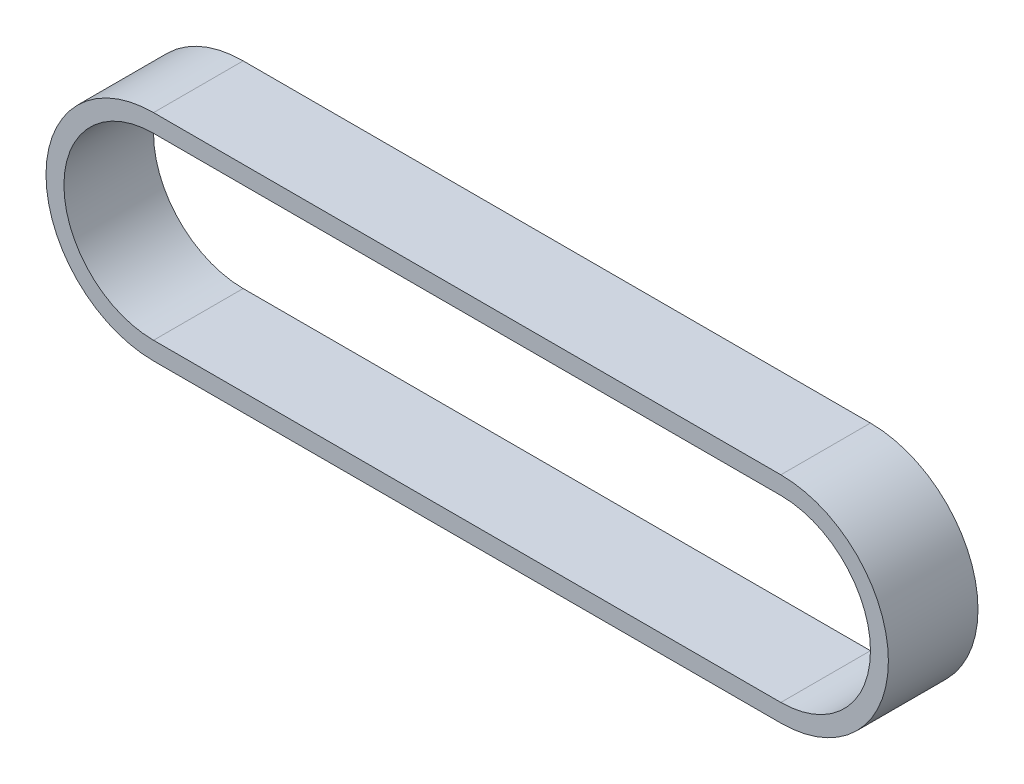
ISO-10303-21;
HEADER;
FILE_DESCRIPTION(('STEP AP214'),'2;1');
FILE_NAME('part.step','',(''),(''),'','','');
FILE_SCHEMA(('AUTOMOTIVE_DESIGN { 1 0 10303 214 1 1 1 1 }'));
ENDSEC;
DATA;
#1=APPLICATION_CONTEXT('core data for automotive mechanical design processes');
#2=APPLICATION_PROTOCOL_DEFINITION('international standard','automotive_design',2000,#1);
#3=PRODUCT_CONTEXT('',#1,'mechanical');
#4=PRODUCT('Part','Part','',(#3));
#5=PRODUCT_RELATED_PRODUCT_CATEGORY('part','',(#4));
#6=PRODUCT_DEFINITION_FORMATION('','',#4);
#7=PRODUCT_DEFINITION_CONTEXT('part definition',#1,'design');
#8=PRODUCT_DEFINITION('design','',#6,#7);
#9=PRODUCT_DEFINITION_SHAPE('','',#8);
#10=(LENGTH_UNIT() NAMED_UNIT(*) SI_UNIT(.MILLI.,.METRE.));
#11=(NAMED_UNIT(*) PLANE_ANGLE_UNIT() SI_UNIT($,.RADIAN.));
#12=(NAMED_UNIT(*) SI_UNIT($,.STERADIAN.) SOLID_ANGLE_UNIT());
#13=UNCERTAINTY_MEASURE_WITH_UNIT(LENGTH_MEASURE(1.E-05),#10,'distance_accuracy_value','');
#14=(GEOMETRIC_REPRESENTATION_CONTEXT(3) GLOBAL_UNCERTAINTY_ASSIGNED_CONTEXT((#13)) GLOBAL_UNIT_ASSIGNED_CONTEXT((#10,
#11,#12)) REPRESENTATION_CONTEXT('',''));
#15=CARTESIAN_POINT('',(0.,0.,0.));
#16=DIRECTION('',(0.,0.,1.));
#17=DIRECTION('',(1.,0.,0.));
#18=AXIS2_PLACEMENT_3D('',#15,#16,#17);
#19=CARTESIAN_POINT('',(0.,0.,5.));
#20=DIRECTION('',(0.,0.,1.));
#21=DIRECTION('',(1.,0.,0.));
#22=AXIS2_PLACEMENT_3D('',#19,#20,#21);
#23=PLANE('',#22);
#24=CARTESIAN_POINT('',(0.,0.,5.));
#25=DIRECTION('',(0.,0.,1.));
#26=DIRECTION('',(1.,0.,0.));
#27=AXIS2_PLACEMENT_3D('',#24,#25,#26);
#28=CIRCLE('',#27,6.);
#29=CARTESIAN_POINT('',(0.,6.,5.));
#30=VERTEX_POINT('',#29);
#31=CARTESIAN_POINT('',(0.,-6.,5.));
#32=VERTEX_POINT('',#31);
#33=EDGE_CURVE('E131',#30,#32,#28,.T.);
#34=ORIENTED_EDGE('',*,*,#33,.T.);
#35=DIRECTION('',(1.,0.,0.));
#36=VECTOR('',#35,1.);
#37=CARTESIAN_POINT('',(0.,-6.,5.));
#38=LINE('',#37,#36);
#39=CARTESIAN_POINT('',(35.,-6.,5.));
#40=VERTEX_POINT('',#39);
#41=EDGE_CURVE('E134',#32,#40,#38,.T.);
#42=ORIENTED_EDGE('',*,*,#41,.T.);
#43=CARTESIAN_POINT('',(35.,0.,5.));
#44=DIRECTION('',(0.,0.,1.));
#45=DIRECTION('',(1.,0.,0.));
#46=AXIS2_PLACEMENT_3D('',#43,#44,#45);
#47=CIRCLE('',#46,6.);
#48=CARTESIAN_POINT('',(35.,6.,5.));
#49=VERTEX_POINT('',#48);
#50=EDGE_CURVE('E137',#40,#49,#47,.T.);
#51=ORIENTED_EDGE('',*,*,#50,.T.);
#52=DIRECTION('',(-1.,0.,0.));
#53=VECTOR('',#52,1.);
#54=CARTESIAN_POINT('',(0.,6.,5.));
#55=LINE('',#54,#53);
#56=EDGE_CURVE('E139',#49,#30,#55,.T.);
#57=ORIENTED_EDGE('',*,*,#56,.T.);
#58=EDGE_LOOP('',(#34,#42,#51,#57));
#59=FACE_BOUND('',#58,.T.);
#60=DIRECTION('',(1.,0.,0.));
#61=VECTOR('',#60,1.);
#62=CARTESIAN_POINT('',(0.,-5.,5.));
#63=LINE('',#62,#61);
#64=CARTESIAN_POINT('',(0.,-5.,5.));
#65=VERTEX_POINT('',#64);
#66=CARTESIAN_POINT('',(35.,-5.,5.));
#67=VERTEX_POINT('',#66);
#68=EDGE_CURVE('E103',#65,#67,#63,.T.);
#69=ORIENTED_EDGE('',*,*,#68,.F.);
#70=CARTESIAN_POINT('',(0.,0.,5.));
#71=DIRECTION('',(0.,0.,1.));
#72=DIRECTION('',(1.,0.,0.));
#73=AXIS2_PLACEMENT_3D('',#70,#71,#72);
#74=CIRCLE('',#73,5.);
#75=CARTESIAN_POINT('',(0.,5.,5.));
#76=VERTEX_POINT('',#75);
#77=EDGE_CURVE('E95',#76,#65,#74,.T.);
#78=ORIENTED_EDGE('',*,*,#77,.F.);
#79=DIRECTION('',(-1.,0.,0.));
#80=VECTOR('',#79,1.);
#81=CARTESIAN_POINT('',(0.,5.,5.));
#82=LINE('',#81,#80);
#83=CARTESIAN_POINT('',(35.,5.,5.));
#84=VERTEX_POINT('',#83);
#85=EDGE_CURVE('E117',#84,#76,#82,.T.);
#86=ORIENTED_EDGE('',*,*,#85,.F.);
#87=CARTESIAN_POINT('',(35.,0.,5.));
#88=DIRECTION('',(0.,0.,1.));
#89=DIRECTION('',(1.,0.,0.));
#90=AXIS2_PLACEMENT_3D('',#87,#88,#89);
#91=CIRCLE('',#90,5.);
#92=EDGE_CURVE('E115',#67,#84,#91,.T.);
#93=ORIENTED_EDGE('',*,*,#92,.F.);
#94=EDGE_LOOP('',(#69,#78,#86,#93));
#95=FACE_BOUND('',#94,.T.);
#96=ADVANCED_FACE('F30',(#59,#95),#23,.T.);
#97=CARTESIAN_POINT('',(0.,0.,0.));
#98=DIRECTION('',(0.,0.,1.));
#99=DIRECTION('',(1.,0.,0.));
#100=AXIS2_PLACEMENT_3D('',#97,#98,#99);
#101=PLANE('',#100);
#102=CARTESIAN_POINT('',(0.,0.,0.));
#103=DIRECTION('',(0.,0.,1.));
#104=DIRECTION('',(1.,0.,0.));
#105=AXIS2_PLACEMENT_3D('',#102,#103,#104);
#106=CIRCLE('',#105,6.);
#107=CARTESIAN_POINT('',(0.,6.,0.));
#108=VERTEX_POINT('',#107);
#109=CARTESIAN_POINT('',(0.,-6.,0.));
#110=VERTEX_POINT('',#109);
#111=EDGE_CURVE('E111',#108,#110,#106,.T.);
#112=ORIENTED_EDGE('',*,*,#111,.F.);
#113=DIRECTION('',(-1.,0.,0.));
#114=VECTOR('',#113,1.);
#115=CARTESIAN_POINT('',(0.,6.,0.));
#116=LINE('',#115,#114);
#117=CARTESIAN_POINT('',(35.,6.,0.));
#118=VERTEX_POINT('',#117);
#119=EDGE_CURVE('E135',#118,#108,#116,.T.);
#120=ORIENTED_EDGE('',*,*,#119,.F.);
#121=CARTESIAN_POINT('',(35.,0.,0.));
#122=DIRECTION('',(0.,0.,1.));
#123=DIRECTION('',(1.,0.,0.));
#124=AXIS2_PLACEMENT_3D('',#121,#122,#123);
#125=CIRCLE('',#124,6.);
#126=CARTESIAN_POINT('',(35.,-6.,0.));
#127=VERTEX_POINT('',#126);
#128=EDGE_CURVE('E146',#127,#118,#125,.T.);
#129=ORIENTED_EDGE('',*,*,#128,.F.);
#130=DIRECTION('',(1.,0.,0.));
#131=VECTOR('',#130,1.);
#132=CARTESIAN_POINT('',(0.,-6.,0.));
#133=LINE('',#132,#131);
#134=EDGE_CURVE('E144',#110,#127,#133,.T.);
#135=ORIENTED_EDGE('',*,*,#134,.F.);
#136=EDGE_LOOP('',(#112,#120,#129,#135));
#137=FACE_BOUND('',#136,.T.);
#138=CARTESIAN_POINT('',(0.,0.,0.));
#139=DIRECTION('',(0.,0.,1.));
#140=DIRECTION('',(1.,0.,0.));
#141=AXIS2_PLACEMENT_3D('',#138,#139,#140);
#142=CIRCLE('',#141,5.);
#143=CARTESIAN_POINT('',(0.,5.,0.));
#144=VERTEX_POINT('',#143);
#145=CARTESIAN_POINT('',(0.,-5.,0.));
#146=VERTEX_POINT('',#145);
#147=EDGE_CURVE('E53',#144,#146,#142,.T.);
#148=ORIENTED_EDGE('',*,*,#147,.T.);
#149=DIRECTION('',(1.,0.,0.));
#150=VECTOR('',#149,1.);
#151=CARTESIAN_POINT('',(0.,-5.,0.));
#152=LINE('',#151,#150);
#153=CARTESIAN_POINT('',(35.,-5.,0.));
#154=VERTEX_POINT('',#153);
#155=EDGE_CURVE('E110',#146,#154,#152,.T.);
#156=ORIENTED_EDGE('',*,*,#155,.T.);
#157=CARTESIAN_POINT('',(35.,0.,0.));
#158=DIRECTION('',(0.,0.,1.));
#159=DIRECTION('',(1.,0.,0.));
#160=AXIS2_PLACEMENT_3D('',#157,#158,#159);
#161=CIRCLE('',#160,5.);
#162=CARTESIAN_POINT('',(35.,5.,0.));
#163=VERTEX_POINT('',#162);
#164=EDGE_CURVE('E123',#154,#163,#161,.T.);
#165=ORIENTED_EDGE('',*,*,#164,.T.);
#166=DIRECTION('',(-1.,0.,0.));
#167=VECTOR('',#166,1.);
#168=CARTESIAN_POINT('',(0.,5.,0.));
#169=LINE('',#168,#167);
#170=EDGE_CURVE('E104',#163,#144,#169,.T.);
#171=ORIENTED_EDGE('',*,*,#170,.T.);
#172=EDGE_LOOP('',(#148,#156,#165,#171));
#173=FACE_BOUND('',#172,.T.);
#174=ADVANCED_FACE('F164',(#137,#173),#101,.F.);
#175=CARTESIAN_POINT('',(0.,0.,5.));
#176=DIRECTION('',(0.,0.,-1.));
#177=DIRECTION('',(-1.,0.,0.));
#178=AXIS2_PLACEMENT_3D('',#175,#176,#177);
#179=CYLINDRICAL_SURFACE('',#178,6.);
#180=ORIENTED_EDGE('',*,*,#111,.T.);
#181=DIRECTION('',(0.,0.,-1.));
#182=VECTOR('',#181,1.);
#183=CARTESIAN_POINT('',(0.,-6.,5.));
#184=LINE('',#183,#182);
#185=EDGE_CURVE('E11',#32,#110,#184,.T.);
#186=ORIENTED_EDGE('',*,*,#185,.F.);
#187=ORIENTED_EDGE('',*,*,#33,.F.);
#188=DIRECTION('',(0.,0.,-1.));
#189=VECTOR('',#188,1.);
#190=CARTESIAN_POINT('',(0.,6.,5.));
#191=LINE('',#190,#189);
#192=EDGE_CURVE('E141',#30,#108,#191,.T.);
#193=ORIENTED_EDGE('',*,*,#192,.T.);
#194=EDGE_LOOP('',(#180,#186,#187,#193));
#195=FACE_BOUND('',#194,.T.);
#196=ADVANCED_FACE('F32',(#195),#179,.T.);
#197=CARTESIAN_POINT('',(0.,-6.,5.));
#198=DIRECTION('',(0.,1.,0.));
#199=DIRECTION('',(0.,0.,1.));
#200=AXIS2_PLACEMENT_3D('',#197,#198,#199);
#201=PLANE('',#200);
#202=ORIENTED_EDGE('',*,*,#134,.T.);
#203=DIRECTION('',(0.,0.,-1.));
#204=VECTOR('',#203,1.);
#205=CARTESIAN_POINT('',(35.,-6.,5.));
#206=LINE('',#205,#204);
#207=EDGE_CURVE('E38',#40,#127,#206,.T.);
#208=ORIENTED_EDGE('',*,*,#207,.F.);
#209=ORIENTED_EDGE('',*,*,#41,.F.);
#210=ORIENTED_EDGE('',*,*,#185,.T.);
#211=EDGE_LOOP('',(#202,#208,#209,#210));
#212=FACE_BOUND('',#211,.T.);
#213=ADVANCED_FACE('F174',(#212),#201,.F.);
#214=CARTESIAN_POINT('',(35.,0.,5.));
#215=DIRECTION('',(0.,0.,-1.));
#216=DIRECTION('',(-1.,0.,0.));
#217=AXIS2_PLACEMENT_3D('',#214,#215,#216);
#218=CYLINDRICAL_SURFACE('',#217,6.);
#219=ORIENTED_EDGE('',*,*,#128,.T.);
#220=DIRECTION('',(0.,0.,-1.));
#221=VECTOR('',#220,1.);
#222=CARTESIAN_POINT('',(35.,6.,5.));
#223=LINE('',#222,#221);
#224=EDGE_CURVE('E151',#49,#118,#223,.T.);
#225=ORIENTED_EDGE('',*,*,#224,.F.);
#226=ORIENTED_EDGE('',*,*,#50,.F.);
#227=ORIENTED_EDGE('',*,*,#207,.T.);
#228=EDGE_LOOP('',(#219,#225,#226,#227));
#229=FACE_BOUND('',#228,.T.);
#230=ADVANCED_FACE('F158',(#229),#218,.T.);
#231=CARTESIAN_POINT('',(0.,6.,5.));
#232=DIRECTION('',(0.,-1.,0.));
#233=DIRECTION('',(0.,0.,-1.));
#234=AXIS2_PLACEMENT_3D('',#231,#232,#233);
#235=PLANE('',#234);
#236=ORIENTED_EDGE('',*,*,#119,.T.);
#237=ORIENTED_EDGE('',*,*,#192,.F.);
#238=ORIENTED_EDGE('',*,*,#56,.F.);
#239=ORIENTED_EDGE('',*,*,#224,.T.);
#240=EDGE_LOOP('',(#236,#237,#238,#239));
#241=FACE_BOUND('',#240,.T.);
#242=ADVANCED_FACE('F168',(#241),#235,.F.);
#243=CARTESIAN_POINT('',(0.,0.,5.));
#244=DIRECTION('',(0.,0.,-1.));
#245=DIRECTION('',(-1.,0.,0.));
#246=AXIS2_PLACEMENT_3D('',#243,#244,#245);
#247=CYLINDRICAL_SURFACE('',#246,5.);
#248=ORIENTED_EDGE('',*,*,#147,.F.);
#249=DIRECTION('',(0.,0.,-1.));
#250=VECTOR('',#249,1.);
#251=CARTESIAN_POINT('',(0.,5.,5.));
#252=LINE('',#251,#250);
#253=EDGE_CURVE('E99',#76,#144,#252,.T.);
#254=ORIENTED_EDGE('',*,*,#253,.F.);
#255=ORIENTED_EDGE('',*,*,#77,.T.);
#256=DIRECTION('',(0.,0.,-1.));
#257=VECTOR('',#256,1.);
#258=CARTESIAN_POINT('',(0.,-5.,5.));
#259=LINE('',#258,#257);
#260=EDGE_CURVE('E98',#65,#146,#259,.T.);
#261=ORIENTED_EDGE('',*,*,#260,.T.);
#262=EDGE_LOOP('',(#248,#254,#255,#261));
#263=FACE_BOUND('',#262,.T.);
#264=ADVANCED_FACE('F97',(#263),#247,.F.);
#265=CARTESIAN_POINT('',(0.,-5.,5.));
#266=DIRECTION('',(0.,1.,0.));
#267=DIRECTION('',(0.,0.,1.));
#268=AXIS2_PLACEMENT_3D('',#265,#266,#267);
#269=PLANE('',#268);
#270=ORIENTED_EDGE('',*,*,#155,.F.);
#271=ORIENTED_EDGE('',*,*,#260,.F.);
#272=ORIENTED_EDGE('',*,*,#68,.T.);
#273=DIRECTION('',(0.,0.,-1.));
#274=VECTOR('',#273,1.);
#275=CARTESIAN_POINT('',(35.,-5.,5.));
#276=LINE('',#275,#274);
#277=EDGE_CURVE('E112',#67,#154,#276,.T.);
#278=ORIENTED_EDGE('',*,*,#277,.T.);
#279=EDGE_LOOP('',(#270,#271,#272,#278));
#280=FACE_BOUND('',#279,.T.);
#281=ADVANCED_FACE('F107',(#280),#269,.T.);
#282=CARTESIAN_POINT('',(35.,0.,5.));
#283=DIRECTION('',(0.,0.,-1.));
#284=DIRECTION('',(-1.,0.,0.));
#285=AXIS2_PLACEMENT_3D('',#282,#283,#284);
#286=CYLINDRICAL_SURFACE('',#285,5.);
#287=ORIENTED_EDGE('',*,*,#164,.F.);
#288=ORIENTED_EDGE('',*,*,#277,.F.);
#289=ORIENTED_EDGE('',*,*,#92,.T.);
#290=DIRECTION('',(0.,0.,-1.));
#291=VECTOR('',#290,1.);
#292=CARTESIAN_POINT('',(35.,5.,5.));
#293=LINE('',#292,#291);
#294=EDGE_CURVE('E45',#84,#163,#293,.T.);
#295=ORIENTED_EDGE('',*,*,#294,.T.);
#296=EDGE_LOOP('',(#287,#288,#289,#295));
#297=FACE_BOUND('',#296,.T.);
#298=ADVANCED_FACE('F197',(#297),#286,.F.);
#299=CARTESIAN_POINT('',(0.,5.,5.));
#300=DIRECTION('',(0.,-1.,0.));
#301=DIRECTION('',(0.,0.,-1.));
#302=AXIS2_PLACEMENT_3D('',#299,#300,#301);
#303=PLANE('',#302);
#304=ORIENTED_EDGE('',*,*,#170,.F.);
#305=ORIENTED_EDGE('',*,*,#294,.F.);
#306=ORIENTED_EDGE('',*,*,#85,.T.);
#307=ORIENTED_EDGE('',*,*,#253,.T.);
#308=EDGE_LOOP('',(#304,#305,#306,#307));
#309=FACE_BOUND('',#308,.T.);
#310=ADVANCED_FACE('F201',(#309),#303,.T.);
#311=CLOSED_SHELL('',(#96,#174,#196,#213,#230,#242,#264,#281,#298,#310));
#312=MANIFOLD_SOLID_BREP('B2',#311);
#313=ADVANCED_BREP_SHAPE_REPRESENTATION('',(#18,#312),#14);
#314=SHAPE_DEFINITION_REPRESENTATION(#9,#313);
ENDSEC;
END-ISO-10303-21;
